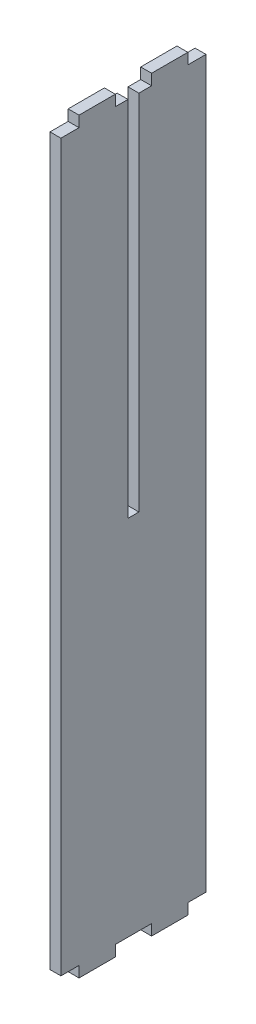
ISO-10303-21;
HEADER;
FILE_DESCRIPTION(('STEP AP214'),'2;1');
FILE_NAME('part.step','',(''),(''),'','','');
FILE_SCHEMA(('AUTOMOTIVE_DESIGN { 1 0 10303 214 1 1 1 1 }'));
ENDSEC;
DATA;
#1=APPLICATION_CONTEXT('core data for automotive mechanical design processes');
#2=APPLICATION_PROTOCOL_DEFINITION('international standard','automotive_design',2000,#1);
#3=PRODUCT_CONTEXT('',#1,'mechanical');
#4=PRODUCT('Part','Part','',(#3));
#5=PRODUCT_RELATED_PRODUCT_CATEGORY('part','',(#4));
#6=PRODUCT_DEFINITION_FORMATION('','',#4);
#7=PRODUCT_DEFINITION_CONTEXT('part definition',#1,'design');
#8=PRODUCT_DEFINITION('design','',#6,#7);
#9=PRODUCT_DEFINITION_SHAPE('','',#8);
#10=(LENGTH_UNIT() NAMED_UNIT(*) SI_UNIT(.MILLI.,.METRE.));
#11=(NAMED_UNIT(*) PLANE_ANGLE_UNIT() SI_UNIT($,.RADIAN.));
#12=(NAMED_UNIT(*) SI_UNIT($,.STERADIAN.) SOLID_ANGLE_UNIT());
#13=UNCERTAINTY_MEASURE_WITH_UNIT(LENGTH_MEASURE(1.E-05),#10,'distance_accuracy_value','');
#14=(GEOMETRIC_REPRESENTATION_CONTEXT(3) GLOBAL_UNCERTAINTY_ASSIGNED_CONTEXT((#13)) GLOBAL_UNIT_ASSIGNED_CONTEXT((#10,
#11,#12)) REPRESENTATION_CONTEXT('',''));
#15=CARTESIAN_POINT('',(0.,0.,0.));
#16=DIRECTION('',(0.,0.,1.));
#17=DIRECTION('',(1.,0.,0.));
#18=AXIS2_PLACEMENT_3D('',#15,#16,#17);
#19=CARTESIAN_POINT('',(1.5,200.,5.));
#20=DIRECTION('',(0.,-1.,0.));
#21=DIRECTION('',(0.,0.,-1.));
#22=AXIS2_PLACEMENT_3D('',#19,#20,#21);
#23=PLANE('',#22);
#24=DIRECTION('',(0.,0.,1.));
#25=VECTOR('',#24,1.);
#26=CARTESIAN_POINT('',(1.5,200.,5.));
#27=LINE('',#26,#25);
#28=CARTESIAN_POINT('',(1.5,200.,1.5));
#29=VERTEX_POINT('',#28);
#30=CARTESIAN_POINT('',(1.5,200.,5.));
#31=VERTEX_POINT('',#30);
#32=EDGE_CURVE('E383',#29,#31,#27,.T.);
#33=ORIENTED_EDGE('',*,*,#32,.F.);
#34=DIRECTION('',(1.,0.,0.));
#35=VECTOR('',#34,1.);
#36=CARTESIAN_POINT('',(-1.501,200.,1.5));
#37=LINE('',#36,#35);
#38=CARTESIAN_POINT('',(-1.5,200.,1.5));
#39=VERTEX_POINT('',#38);
#40=EDGE_CURVE('E464',#39,#29,#37,.T.);
#41=ORIENTED_EDGE('',*,*,#40,.F.);
#42=DIRECTION('',(0.,0.,1.));
#43=VECTOR('',#42,1.);
#44=CARTESIAN_POINT('',(-1.5,200.,5.));
#45=LINE('',#44,#43);
#46=CARTESIAN_POINT('',(-1.5,200.,5.));
#47=VERTEX_POINT('',#46);
#48=EDGE_CURVE('E240',#39,#47,#45,.T.);
#49=ORIENTED_EDGE('',*,*,#48,.T.);
#50=DIRECTION('',(-1.,0.,0.));
#51=VECTOR('',#50,1.);
#52=CARTESIAN_POINT('',(1.5,200.,5.));
#53=LINE('',#52,#51);
#54=EDGE_CURVE('E339',#31,#47,#53,.T.);
#55=ORIENTED_EDGE('',*,*,#54,.F.);
#56=EDGE_LOOP('',(#33,#41,#49,#55));
#57=FACE_BOUND('',#56,.T.);
#58=ADVANCED_FACE('F39',(#57),#23,.F.);
#59=CARTESIAN_POINT('',(1.5,200.,-20.));
#60=DIRECTION('',(0.,-1.,0.));
#61=DIRECTION('',(0.,0.,-1.));
#62=AXIS2_PLACEMENT_3D('',#59,#60,#61);
#63=PLANE('',#62);
#64=DIRECTION('',(0.,0.,1.));
#65=VECTOR('',#64,1.);
#66=CARTESIAN_POINT('',(-1.5,200.,-20.));
#67=LINE('',#66,#65);
#68=CARTESIAN_POINT('',(-1.5,200.,-20.));
#69=VERTEX_POINT('',#68);
#70=CARTESIAN_POINT('',(-1.5,200.,-15.));
#71=VERTEX_POINT('',#70);
#72=EDGE_CURVE('E226',#69,#71,#67,.T.);
#73=ORIENTED_EDGE('',*,*,#72,.T.);
#74=DIRECTION('',(-1.,0.,0.));
#75=VECTOR('',#74,1.);
#76=CARTESIAN_POINT('',(1.5,200.,-15.));
#77=LINE('',#76,#75);
#78=CARTESIAN_POINT('',(1.5,200.,-15.));
#79=VERTEX_POINT('',#78);
#80=EDGE_CURVE('E11',#79,#71,#77,.T.);
#81=ORIENTED_EDGE('',*,*,#80,.F.);
#82=DIRECTION('',(0.,0.,1.));
#83=VECTOR('',#82,1.);
#84=CARTESIAN_POINT('',(1.5,200.,-20.));
#85=LINE('',#84,#83);
#86=CARTESIAN_POINT('',(1.5,200.,-20.));
#87=VERTEX_POINT('',#86);
#88=EDGE_CURVE('E288',#87,#79,#85,.T.);
#89=ORIENTED_EDGE('',*,*,#88,.F.);
#90=DIRECTION('',(-1.,0.,0.));
#91=VECTOR('',#90,1.);
#92=CARTESIAN_POINT('',(1.5,200.,-20.));
#93=LINE('',#92,#91);
#94=EDGE_CURVE('E222',#87,#69,#93,.T.);
#95=ORIENTED_EDGE('',*,*,#94,.T.);
#96=EDGE_LOOP('',(#73,#81,#89,#95));
#97=FACE_BOUND('',#96,.T.);
#98=ADVANCED_FACE('F41',(#97),#63,.F.);
#99=CARTESIAN_POINT('',(1.5,200.,-15.));
#100=DIRECTION('',(0.,0.,1.));
#101=DIRECTION('',(1.,0.,0.));
#102=AXIS2_PLACEMENT_3D('',#99,#100,#101);
#103=PLANE('',#102);
#104=DIRECTION('',(0.,1.,0.));
#105=VECTOR('',#104,1.);
#106=CARTESIAN_POINT('',(-1.5,200.,-15.));
#107=LINE('',#106,#105);
#108=CARTESIAN_POINT('',(-1.5,203.,-15.));
#109=VERTEX_POINT('',#108);
#110=EDGE_CURVE('E230',#71,#109,#107,.T.);
#111=ORIENTED_EDGE('',*,*,#110,.T.);
#112=DIRECTION('',(-1.,0.,0.));
#113=VECTOR('',#112,1.);
#114=CARTESIAN_POINT('',(1.5,203.,-15.));
#115=LINE('',#114,#113);
#116=CARTESIAN_POINT('',(1.5,203.,-15.));
#117=VERTEX_POINT('',#116);
#118=EDGE_CURVE('E48',#117,#109,#115,.T.);
#119=ORIENTED_EDGE('',*,*,#118,.F.);
#120=DIRECTION('',(0.,1.,0.));
#121=VECTOR('',#120,1.);
#122=CARTESIAN_POINT('',(1.5,200.,-15.));
#123=LINE('',#122,#121);
#124=EDGE_CURVE('E141',#79,#117,#123,.T.);
#125=ORIENTED_EDGE('',*,*,#124,.F.);
#126=ORIENTED_EDGE('',*,*,#80,.T.);
#127=EDGE_LOOP('',(#111,#119,#125,#126));
#128=FACE_BOUND('',#127,.T.);
#129=ADVANCED_FACE('F598',(#128),#103,.F.);
#130=CARTESIAN_POINT('',(1.5,203.,-15.));
#131=DIRECTION('',(0.,-1.,0.));
#132=DIRECTION('',(0.,0.,-1.));
#133=AXIS2_PLACEMENT_3D('',#130,#131,#132);
#134=PLANE('',#133);
#135=DIRECTION('',(0.,0.,1.));
#136=VECTOR('',#135,1.);
#137=CARTESIAN_POINT('',(-1.5,203.,-15.));
#138=LINE('',#137,#136);
#139=CARTESIAN_POINT('',(-1.5,203.,-5.));
#140=VERTEX_POINT('',#139);
#141=EDGE_CURVE('E234',#109,#140,#138,.T.);
#142=ORIENTED_EDGE('',*,*,#141,.T.);
#143=DIRECTION('',(-1.,0.,0.));
#144=VECTOR('',#143,1.);
#145=CARTESIAN_POINT('',(1.5,203.,-5.));
#146=LINE('',#145,#144);
#147=CARTESIAN_POINT('',(1.5,203.,-5.));
#148=VERTEX_POINT('',#147);
#149=EDGE_CURVE('E347',#148,#140,#146,.T.);
#150=ORIENTED_EDGE('',*,*,#149,.F.);
#151=DIRECTION('',(0.,0.,1.));
#152=VECTOR('',#151,1.);
#153=CARTESIAN_POINT('',(1.5,203.,-15.));
#154=LINE('',#153,#152);
#155=EDGE_CURVE('E358',#117,#148,#154,.T.);
#156=ORIENTED_EDGE('',*,*,#155,.F.);
#157=ORIENTED_EDGE('',*,*,#118,.T.);
#158=EDGE_LOOP('',(#142,#150,#156,#157));
#159=FACE_BOUND('',#158,.T.);
#160=ADVANCED_FACE('F356',(#159),#134,.F.);
#161=CARTESIAN_POINT('',(1.5,200.,-5.));
#162=DIRECTION('',(0.,0.,-1.));
#163=DIRECTION('',(0.,1.,0.));
#164=AXIS2_PLACEMENT_3D('',#161,#162,#163);
#165=PLANE('',#164);
#166=DIRECTION('',(0.,-1.,0.));
#167=VECTOR('',#166,1.);
#168=CARTESIAN_POINT('',(-1.5,200.,-5.));
#169=LINE('',#168,#167);
#170=CARTESIAN_POINT('',(-1.5,200.,-5.));
#171=VERTEX_POINT('',#170);
#172=EDGE_CURVE('E237',#140,#171,#169,.T.);
#173=ORIENTED_EDGE('',*,*,#172,.T.);
#174=DIRECTION('',(-1.,0.,0.));
#175=VECTOR('',#174,1.);
#176=CARTESIAN_POINT('',(1.5,200.,-5.));
#177=LINE('',#176,#175);
#178=CARTESIAN_POINT('',(1.5,200.,-5.));
#179=VERTEX_POINT('',#178);
#180=EDGE_CURVE('E343',#179,#171,#177,.T.);
#181=ORIENTED_EDGE('',*,*,#180,.F.);
#182=DIRECTION('',(0.,-1.,0.));
#183=VECTOR('',#182,1.);
#184=CARTESIAN_POINT('',(1.5,200.,-5.));
#185=LINE('',#184,#183);
#186=EDGE_CURVE('E391',#148,#179,#185,.T.);
#187=ORIENTED_EDGE('',*,*,#186,.F.);
#188=ORIENTED_EDGE('',*,*,#149,.T.);
#189=EDGE_LOOP('',(#173,#181,#187,#188));
#190=FACE_BOUND('',#189,.T.);
#191=ADVANCED_FACE('F368',(#190),#165,.F.);
#192=CARTESIAN_POINT('',(-1.5,200.,-1.49999999999999));
#193=VERTEX_POINT('',#192);
#194=EDGE_CURVE('E241',#171,#193,#45,.T.);
#195=ORIENTED_EDGE('',*,*,#194,.T.);
#196=DIRECTION('',(1.,0.,0.));
#197=VECTOR('',#196,1.);
#198=CARTESIAN_POINT('',(-1.501,200.,-1.5));
#199=LINE('',#198,#197);
#200=CARTESIAN_POINT('',(1.5,200.,-1.5));
#201=VERTEX_POINT('',#200);
#202=EDGE_CURVE('E379',#193,#201,#199,.T.);
#203=ORIENTED_EDGE('',*,*,#202,.T.);
#204=EDGE_CURVE('E376',#179,#201,#27,.T.);
#205=ORIENTED_EDGE('',*,*,#204,.F.);
#206=ORIENTED_EDGE('',*,*,#180,.T.);
#207=EDGE_LOOP('',(#195,#203,#205,#206));
#208=FACE_BOUND('',#207,.T.);
#209=ADVANCED_FACE('F372',(#208),#23,.F.);
#210=CARTESIAN_POINT('',(1.5,203.,5.));
#211=DIRECTION('',(0.,0.,1.));
#212=DIRECTION('',(0.,-1.,0.));
#213=AXIS2_PLACEMENT_3D('',#210,#211,#212);
#214=PLANE('',#213);
#215=DIRECTION('',(0.,1.,0.));
#216=VECTOR('',#215,1.);
#217=CARTESIAN_POINT('',(-1.5,203.,5.));
#218=LINE('',#217,#216);
#219=CARTESIAN_POINT('',(-1.5,203.,5.));
#220=VERTEX_POINT('',#219);
#221=EDGE_CURVE('E245',#47,#220,#218,.T.);
#222=ORIENTED_EDGE('',*,*,#221,.T.);
#223=DIRECTION('',(-1.,0.,0.));
#224=VECTOR('',#223,1.);
#225=CARTESIAN_POINT('',(1.5,203.,5.));
#226=LINE('',#225,#224);
#227=CARTESIAN_POINT('',(1.5,203.,5.));
#228=VERTEX_POINT('',#227);
#229=EDGE_CURVE('E335',#228,#220,#226,.T.);
#230=ORIENTED_EDGE('',*,*,#229,.F.);
#231=DIRECTION('',(0.,1.,0.));
#232=VECTOR('',#231,1.);
#233=CARTESIAN_POINT('',(1.5,203.,5.));
#234=LINE('',#233,#232);
#235=EDGE_CURVE('E382',#31,#228,#234,.T.);
#236=ORIENTED_EDGE('',*,*,#235,.F.);
#237=ORIENTED_EDGE('',*,*,#54,.T.);
#238=EDGE_LOOP('',(#222,#230,#236,#237));
#239=FACE_BOUND('',#238,.T.);
#240=ADVANCED_FACE('F542',(#239),#214,.F.);
#241=CARTESIAN_POINT('',(1.5,203.,15.));
#242=DIRECTION('',(0.,-1.,0.));
#243=DIRECTION('',(0.,0.,-1.));
#244=AXIS2_PLACEMENT_3D('',#241,#242,#243);
#245=PLANE('',#244);
#246=DIRECTION('',(0.,0.,1.));
#247=VECTOR('',#246,1.);
#248=CARTESIAN_POINT('',(-1.5,203.,15.));
#249=LINE('',#248,#247);
#250=CARTESIAN_POINT('',(-1.5,203.,15.));
#251=VERTEX_POINT('',#250);
#252=EDGE_CURVE('E248',#220,#251,#249,.T.);
#253=ORIENTED_EDGE('',*,*,#252,.T.);
#254=DIRECTION('',(-1.,0.,0.));
#255=VECTOR('',#254,1.);
#256=CARTESIAN_POINT('',(1.5,203.,15.));
#257=LINE('',#256,#255);
#258=CARTESIAN_POINT('',(1.5,203.,15.));
#259=VERTEX_POINT('',#258);
#260=EDGE_CURVE('E331',#259,#251,#257,.T.);
#261=ORIENTED_EDGE('',*,*,#260,.F.);
#262=DIRECTION('',(0.,0.,1.));
#263=VECTOR('',#262,1.);
#264=CARTESIAN_POINT('',(1.5,203.,15.));
#265=LINE('',#264,#263);
#266=EDGE_CURVE('E388',#228,#259,#265,.T.);
#267=ORIENTED_EDGE('',*,*,#266,.F.);
#268=ORIENTED_EDGE('',*,*,#229,.T.);
#269=EDGE_LOOP('',(#253,#261,#267,#268));
#270=FACE_BOUND('',#269,.T.);
#271=ADVANCED_FACE('F546',(#270),#245,.F.);
#272=CARTESIAN_POINT('',(1.5,200.,15.));
#273=DIRECTION('',(0.,0.,-1.));
#274=DIRECTION('',(-1.,0.,0.));
#275=AXIS2_PLACEMENT_3D('',#272,#273,#274);
#276=PLANE('',#275);
#277=DIRECTION('',(0.,-1.,0.));
#278=VECTOR('',#277,1.);
#279=CARTESIAN_POINT('',(-1.5,200.,15.));
#280=LINE('',#279,#278);
#281=CARTESIAN_POINT('',(-1.5,200.,15.));
#282=VERTEX_POINT('',#281);
#283=EDGE_CURVE('E251',#251,#282,#280,.T.);
#284=ORIENTED_EDGE('',*,*,#283,.T.);
#285=DIRECTION('',(-1.,0.,0.));
#286=VECTOR('',#285,1.);
#287=CARTESIAN_POINT('',(1.5,200.,15.));
#288=LINE('',#287,#286);
#289=CARTESIAN_POINT('',(1.5,200.,15.));
#290=VERTEX_POINT('',#289);
#291=EDGE_CURVE('E327',#290,#282,#288,.T.);
#292=ORIENTED_EDGE('',*,*,#291,.F.);
#293=DIRECTION('',(0.,-1.,0.));
#294=VECTOR('',#293,1.);
#295=CARTESIAN_POINT('',(1.5,200.,15.));
#296=LINE('',#295,#294);
#297=EDGE_CURVE('E397',#259,#290,#296,.T.);
#298=ORIENTED_EDGE('',*,*,#297,.F.);
#299=ORIENTED_EDGE('',*,*,#260,.T.);
#300=EDGE_LOOP('',(#284,#292,#298,#299));
#301=FACE_BOUND('',#300,.T.);
#302=ADVANCED_FACE('F553',(#301),#276,.F.);
#303=CARTESIAN_POINT('',(1.5,200.,20.));
#304=DIRECTION('',(0.,-1.,0.));
#305=DIRECTION('',(0.,0.,-1.));
#306=AXIS2_PLACEMENT_3D('',#303,#304,#305);
#307=PLANE('',#306);
#308=DIRECTION('',(0.,0.,1.));
#309=VECTOR('',#308,1.);
#310=CARTESIAN_POINT('',(-1.5,200.,20.));
#311=LINE('',#310,#309);
#312=CARTESIAN_POINT('',(-1.5,200.,20.));
#313=VERTEX_POINT('',#312);
#314=EDGE_CURVE('E254',#282,#313,#311,.T.);
#315=ORIENTED_EDGE('',*,*,#314,.T.);
#316=DIRECTION('',(-1.,0.,0.));
#317=VECTOR('',#316,1.);
#318=CARTESIAN_POINT('',(1.5,200.,20.));
#319=LINE('',#318,#317);
#320=CARTESIAN_POINT('',(1.5,200.,20.));
#321=VERTEX_POINT('',#320);
#322=EDGE_CURVE('E323',#321,#313,#319,.T.);
#323=ORIENTED_EDGE('',*,*,#322,.F.);
#324=DIRECTION('',(0.,0.,1.));
#325=VECTOR('',#324,1.);
#326=CARTESIAN_POINT('',(1.5,200.,20.));
#327=LINE('',#326,#325);
#328=EDGE_CURVE('E400',#290,#321,#327,.T.);
#329=ORIENTED_EDGE('',*,*,#328,.F.);
#330=ORIENTED_EDGE('',*,*,#291,.T.);
#331=EDGE_LOOP('',(#315,#323,#329,#330));
#332=FACE_BOUND('',#331,.T.);
#333=ADVANCED_FACE('F556',(#332),#307,.F.);
#334=CARTESIAN_POINT('',(1.5,0.,20.));
#335=DIRECTION('',(0.,0.,-1.));
#336=DIRECTION('',(-1.,0.,0.));
#337=AXIS2_PLACEMENT_3D('',#334,#335,#336);
#338=PLANE('',#337);
#339=DIRECTION('',(0.,-1.,0.));
#340=VECTOR('',#339,1.);
#341=CARTESIAN_POINT('',(-1.5,0.,20.));
#342=LINE('',#341,#340);
#343=CARTESIAN_POINT('',(-1.5,0.,20.));
#344=VERTEX_POINT('',#343);
#345=EDGE_CURVE('E257',#313,#344,#342,.T.);
#346=ORIENTED_EDGE('',*,*,#345,.T.);
#347=DIRECTION('',(-1.,0.,0.));
#348=VECTOR('',#347,1.);
#349=CARTESIAN_POINT('',(1.5,0.,20.));
#350=LINE('',#349,#348);
#351=CARTESIAN_POINT('',(1.5,0.,20.));
#352=VERTEX_POINT('',#351);
#353=EDGE_CURVE('E319',#352,#344,#350,.T.);
#354=ORIENTED_EDGE('',*,*,#353,.F.);
#355=DIRECTION('',(0.,-1.,0.));
#356=VECTOR('',#355,1.);
#357=CARTESIAN_POINT('',(1.5,0.,20.));
#358=LINE('',#357,#356);
#359=EDGE_CURVE('E403',#321,#352,#358,.T.);
#360=ORIENTED_EDGE('',*,*,#359,.F.);
#361=ORIENTED_EDGE('',*,*,#322,.T.);
#362=EDGE_LOOP('',(#346,#354,#360,#361));
#363=FACE_BOUND('',#362,.T.);
#364=ADVANCED_FACE('F561',(#363),#338,.F.);
#365=CARTESIAN_POINT('',(1.5,0.,20.));
#366=DIRECTION('',(0.,1.,0.));
#367=DIRECTION('',(0.,0.,1.));
#368=AXIS2_PLACEMENT_3D('',#365,#366,#367);
#369=PLANE('',#368);
#370=DIRECTION('',(0.,0.,-1.));
#371=VECTOR('',#370,1.);
#372=CARTESIAN_POINT('',(-1.5,0.,20.));
#373=LINE('',#372,#371);
#374=CARTESIAN_POINT('',(-1.5,0.,15.));
#375=VERTEX_POINT('',#374);
#376=EDGE_CURVE('E260',#344,#375,#373,.T.);
#377=ORIENTED_EDGE('',*,*,#376,.T.);
#378=DIRECTION('',(-1.,0.,0.));
#379=VECTOR('',#378,1.);
#380=CARTESIAN_POINT('',(1.5,0.,15.));
#381=LINE('',#380,#379);
#382=CARTESIAN_POINT('',(1.5,0.,15.));
#383=VERTEX_POINT('',#382);
#384=EDGE_CURVE('E315',#383,#375,#381,.T.);
#385=ORIENTED_EDGE('',*,*,#384,.F.);
#386=DIRECTION('',(0.,0.,-1.));
#387=VECTOR('',#386,1.);
#388=CARTESIAN_POINT('',(1.5,0.,20.));
#389=LINE('',#388,#387);
#390=EDGE_CURVE('E406',#352,#383,#389,.T.);
#391=ORIENTED_EDGE('',*,*,#390,.F.);
#392=ORIENTED_EDGE('',*,*,#353,.T.);
#393=EDGE_LOOP('',(#377,#385,#391,#392));
#394=FACE_BOUND('',#393,.T.);
#395=ADVANCED_FACE('F567',(#394),#369,.F.);
#396=CARTESIAN_POINT('',(1.5,0.,15.));
#397=DIRECTION('',(0.,0.,-1.));
#398=DIRECTION('',(0.,1.,0.));
#399=AXIS2_PLACEMENT_3D('',#396,#397,#398);
#400=PLANE('',#399);
#401=DIRECTION('',(0.,-1.,0.));
#402=VECTOR('',#401,1.);
#403=CARTESIAN_POINT('',(-1.5,0.,15.));
#404=LINE('',#403,#402);
#405=CARTESIAN_POINT('',(-1.5,-3.,15.));
#406=VERTEX_POINT('',#405);
#407=EDGE_CURVE('E263',#375,#406,#404,.T.);
#408=ORIENTED_EDGE('',*,*,#407,.T.);
#409=DIRECTION('',(-1.,0.,0.));
#410=VECTOR('',#409,1.);
#411=CARTESIAN_POINT('',(1.5,-3.,15.));
#412=LINE('',#411,#410);
#413=CARTESIAN_POINT('',(1.5,-3.,15.));
#414=VERTEX_POINT('',#413);
#415=EDGE_CURVE('E311',#414,#406,#412,.T.);
#416=ORIENTED_EDGE('',*,*,#415,.F.);
#417=DIRECTION('',(0.,-1.,0.));
#418=VECTOR('',#417,1.);
#419=CARTESIAN_POINT('',(1.5,0.,15.));
#420=LINE('',#419,#418);
#421=EDGE_CURVE('E409',#383,#414,#420,.T.);
#422=ORIENTED_EDGE('',*,*,#421,.F.);
#423=ORIENTED_EDGE('',*,*,#384,.T.);
#424=EDGE_LOOP('',(#408,#416,#422,#423));
#425=FACE_BOUND('',#424,.T.);
#426=ADVANCED_FACE('F571',(#425),#400,.F.);
#427=CARTESIAN_POINT('',(1.5,-3.,15.));
#428=DIRECTION('',(0.,1.,0.));
#429=DIRECTION('',(0.,0.,1.));
#430=AXIS2_PLACEMENT_3D('',#427,#428,#429);
#431=PLANE('',#430);
#432=DIRECTION('',(0.,0.,-1.));
#433=VECTOR('',#432,1.);
#434=CARTESIAN_POINT('',(-1.5,-3.,15.));
#435=LINE('',#434,#433);
#436=CARTESIAN_POINT('',(-1.5,-3.,4.99999999999998));
#437=VERTEX_POINT('',#436);
#438=EDGE_CURVE('E266',#406,#437,#435,.T.);
#439=ORIENTED_EDGE('',*,*,#438,.T.);
#440=DIRECTION('',(-1.,0.,0.));
#441=VECTOR('',#440,1.);
#442=CARTESIAN_POINT('',(1.5,-3.,4.99999999999998));
#443=LINE('',#442,#441);
#444=CARTESIAN_POINT('',(1.5,-3.,4.99999999999998));
#445=VERTEX_POINT('',#444);
#446=EDGE_CURVE('E307',#445,#437,#443,.T.);
#447=ORIENTED_EDGE('',*,*,#446,.F.);
#448=DIRECTION('',(0.,0.,-1.));
#449=VECTOR('',#448,1.);
#450=CARTESIAN_POINT('',(1.5,-3.,15.));
#451=LINE('',#450,#449);
#452=EDGE_CURVE('E412',#414,#445,#451,.T.);
#453=ORIENTED_EDGE('',*,*,#452,.F.);
#454=ORIENTED_EDGE('',*,*,#415,.T.);
#455=EDGE_LOOP('',(#439,#447,#453,#454));
#456=FACE_BOUND('',#455,.T.);
#457=ADVANCED_FACE('F576',(#456),#431,.F.);
#458=CARTESIAN_POINT('',(1.5,-3.,4.99999999999998));
#459=DIRECTION('',(0.,0.,1.));
#460=DIRECTION('',(1.,0.,0.));
#461=AXIS2_PLACEMENT_3D('',#458,#459,#460);
#462=PLANE('',#461);
#463=DIRECTION('',(0.,1.,0.));
#464=VECTOR('',#463,1.);
#465=CARTESIAN_POINT('',(-1.5,-3.,4.99999999999998));
#466=LINE('',#465,#464);
#467=CARTESIAN_POINT('',(-1.5,0.,4.99999999999998));
#468=VERTEX_POINT('',#467);
#469=EDGE_CURVE('E269',#437,#468,#466,.T.);
#470=ORIENTED_EDGE('',*,*,#469,.T.);
#471=DIRECTION('',(-1.,0.,0.));
#472=VECTOR('',#471,1.);
#473=CARTESIAN_POINT('',(1.5,0.,4.99999999999998));
#474=LINE('',#473,#472);
#475=CARTESIAN_POINT('',(1.5,0.,4.99999999999998));
#476=VERTEX_POINT('',#475);
#477=EDGE_CURVE('E303',#476,#468,#474,.T.);
#478=ORIENTED_EDGE('',*,*,#477,.F.);
#479=DIRECTION('',(0.,1.,0.));
#480=VECTOR('',#479,1.);
#481=CARTESIAN_POINT('',(1.5,-3.,4.99999999999998));
#482=LINE('',#481,#480);
#483=EDGE_CURVE('E415',#445,#476,#482,.T.);
#484=ORIENTED_EDGE('',*,*,#483,.F.);
#485=ORIENTED_EDGE('',*,*,#446,.T.);
#486=EDGE_LOOP('',(#470,#478,#484,#485));
#487=FACE_BOUND('',#486,.T.);
#488=ADVANCED_FACE('F580',(#487),#462,.F.);
#489=CARTESIAN_POINT('',(1.5,0.,4.99999999999998));
#490=DIRECTION('',(0.,1.,0.));
#491=DIRECTION('',(0.,0.,1.));
#492=AXIS2_PLACEMENT_3D('',#489,#490,#491);
#493=PLANE('',#492);
#494=DIRECTION('',(0.,0.,-1.));
#495=VECTOR('',#494,1.);
#496=CARTESIAN_POINT('',(-1.5,0.,4.99999999999998));
#497=LINE('',#496,#495);
#498=CARTESIAN_POINT('',(-1.5,0.,-4.99999999999998));
#499=VERTEX_POINT('',#498);
#500=EDGE_CURVE('E272',#468,#499,#497,.T.);
#501=ORIENTED_EDGE('',*,*,#500,.T.);
#502=DIRECTION('',(-1.,0.,0.));
#503=VECTOR('',#502,1.);
#504=CARTESIAN_POINT('',(1.5,0.,-4.99999999999998));
#505=LINE('',#504,#503);
#506=CARTESIAN_POINT('',(1.5,0.,-4.99999999999998));
#507=VERTEX_POINT('',#506);
#508=EDGE_CURVE('E299',#507,#499,#505,.T.);
#509=ORIENTED_EDGE('',*,*,#508,.F.);
#510=DIRECTION('',(0.,0.,-1.));
#511=VECTOR('',#510,1.);
#512=CARTESIAN_POINT('',(1.5,0.,4.99999999999998));
#513=LINE('',#512,#511);
#514=EDGE_CURVE('E418',#476,#507,#513,.T.);
#515=ORIENTED_EDGE('',*,*,#514,.F.);
#516=ORIENTED_EDGE('',*,*,#477,.T.);
#517=EDGE_LOOP('',(#501,#509,#515,#516));
#518=FACE_BOUND('',#517,.T.);
#519=ADVANCED_FACE('F584',(#518),#493,.F.);
#520=CARTESIAN_POINT('',(1.5,0.,-4.99999999999998));
#521=DIRECTION('',(0.,0.,-1.));
#522=DIRECTION('',(-1.,0.,0.));
#523=AXIS2_PLACEMENT_3D('',#520,#521,#522);
#524=PLANE('',#523);
#525=DIRECTION('',(0.,-1.,0.));
#526=VECTOR('',#525,1.);
#527=CARTESIAN_POINT('',(-1.5,0.,-4.99999999999998));
#528=LINE('',#527,#526);
#529=CARTESIAN_POINT('',(-1.5,-3.,-4.99999999999998));
#530=VERTEX_POINT('',#529);
#531=EDGE_CURVE('E275',#499,#530,#528,.T.);
#532=ORIENTED_EDGE('',*,*,#531,.T.);
#533=DIRECTION('',(-1.,0.,0.));
#534=VECTOR('',#533,1.);
#535=CARTESIAN_POINT('',(1.5,-3.,-4.99999999999998));
#536=LINE('',#535,#534);
#537=CARTESIAN_POINT('',(1.5,-3.,-4.99999999999998));
#538=VERTEX_POINT('',#537);
#539=EDGE_CURVE('E295',#538,#530,#536,.T.);
#540=ORIENTED_EDGE('',*,*,#539,.F.);
#541=DIRECTION('',(0.,-1.,0.));
#542=VECTOR('',#541,1.);
#543=CARTESIAN_POINT('',(1.5,0.,-4.99999999999998));
#544=LINE('',#543,#542);
#545=EDGE_CURVE('E421',#507,#538,#544,.T.);
#546=ORIENTED_EDGE('',*,*,#545,.F.);
#547=ORIENTED_EDGE('',*,*,#508,.T.);
#548=EDGE_LOOP('',(#532,#540,#546,#547));
#549=FACE_BOUND('',#548,.T.);
#550=ADVANCED_FACE('F442',(#549),#524,.F.);
#551=CARTESIAN_POINT('',(1.5,-3.,-4.99999999999998));
#552=DIRECTION('',(0.,1.,0.));
#553=DIRECTION('',(0.,0.,1.));
#554=AXIS2_PLACEMENT_3D('',#551,#552,#553);
#555=PLANE('',#554);
#556=DIRECTION('',(0.,0.,-1.));
#557=VECTOR('',#556,1.);
#558=CARTESIAN_POINT('',(-1.5,-3.,-4.99999999999998));
#559=LINE('',#558,#557);
#560=CARTESIAN_POINT('',(-1.5,-3.,-15.));
#561=VERTEX_POINT('',#560);
#562=EDGE_CURVE('E278',#530,#561,#559,.T.);
#563=ORIENTED_EDGE('',*,*,#562,.T.);
#564=DIRECTION('',(-1.,0.,0.));
#565=VECTOR('',#564,1.);
#566=CARTESIAN_POINT('',(1.5,-3.,-15.));
#567=LINE('',#566,#565);
#568=CARTESIAN_POINT('',(1.5,-3.,-15.));
#569=VERTEX_POINT('',#568);
#570=EDGE_CURVE('E214',#569,#561,#567,.T.);
#571=ORIENTED_EDGE('',*,*,#570,.F.);
#572=DIRECTION('',(0.,0.,-1.));
#573=VECTOR('',#572,1.);
#574=CARTESIAN_POINT('',(1.5,-3.,-4.99999999999998));
#575=LINE('',#574,#573);
#576=EDGE_CURVE('E200',#538,#569,#575,.T.);
#577=ORIENTED_EDGE('',*,*,#576,.F.);
#578=ORIENTED_EDGE('',*,*,#539,.T.);
#579=EDGE_LOOP('',(#563,#571,#577,#578));
#580=FACE_BOUND('',#579,.T.);
#581=ADVANCED_FACE('F446',(#580),#555,.F.);
#582=CARTESIAN_POINT('',(1.5,-3.,-15.));
#583=DIRECTION('',(0.,0.,1.));
#584=DIRECTION('',(0.,-1.,0.));
#585=AXIS2_PLACEMENT_3D('',#582,#583,#584);
#586=PLANE('',#585);
#587=DIRECTION('',(0.,1.,0.));
#588=VECTOR('',#587,1.);
#589=CARTESIAN_POINT('',(-1.5,-3.,-15.));
#590=LINE('',#589,#588);
#591=CARTESIAN_POINT('',(-1.5,0.,-15.));
#592=VERTEX_POINT('',#591);
#593=EDGE_CURVE('E210',#561,#592,#590,.T.);
#594=ORIENTED_EDGE('',*,*,#593,.T.);
#595=DIRECTION('',(-1.,0.,0.));
#596=VECTOR('',#595,1.);
#597=CARTESIAN_POINT('',(1.5,0.,-15.));
#598=LINE('',#597,#596);
#599=CARTESIAN_POINT('',(1.5,0.,-15.));
#600=VERTEX_POINT('',#599);
#601=EDGE_CURVE('E207',#600,#592,#598,.T.);
#602=ORIENTED_EDGE('',*,*,#601,.F.);
#603=DIRECTION('',(0.,1.,0.));
#604=VECTOR('',#603,1.);
#605=CARTESIAN_POINT('',(1.5,-3.,-15.));
#606=LINE('',#605,#604);
#607=EDGE_CURVE('E192',#569,#600,#606,.T.);
#608=ORIENTED_EDGE('',*,*,#607,.F.);
#609=ORIENTED_EDGE('',*,*,#570,.T.);
#610=EDGE_LOOP('',(#594,#602,#608,#609));
#611=FACE_BOUND('',#610,.T.);
#612=ADVANCED_FACE('F208',(#611),#586,.F.);
#613=CARTESIAN_POINT('',(1.5,0.,-15.));
#614=DIRECTION('',(0.,1.,0.));
#615=DIRECTION('',(0.,0.,1.));
#616=AXIS2_PLACEMENT_3D('',#613,#614,#615);
#617=PLANE('',#616);
#618=DIRECTION('',(0.,0.,-1.));
#619=VECTOR('',#618,1.);
#620=CARTESIAN_POINT('',(-1.5,0.,-15.));
#621=LINE('',#620,#619);
#622=CARTESIAN_POINT('',(-1.5,0.,-20.));
#623=VERTEX_POINT('',#622);
#624=EDGE_CURVE('E283',#592,#623,#621,.T.);
#625=ORIENTED_EDGE('',*,*,#624,.T.);
#626=DIRECTION('',(-1.,0.,0.));
#627=VECTOR('',#626,1.);
#628=CARTESIAN_POINT('',(1.5,0.,-20.));
#629=LINE('',#628,#627);
#630=CARTESIAN_POINT('',(1.5,0.,-20.));
#631=VERTEX_POINT('',#630);
#632=EDGE_CURVE('E215',#631,#623,#629,.T.);
#633=ORIENTED_EDGE('',*,*,#632,.F.);
#634=DIRECTION('',(0.,0.,-1.));
#635=VECTOR('',#634,1.);
#636=CARTESIAN_POINT('',(1.5,0.,-15.));
#637=LINE('',#636,#635);
#638=EDGE_CURVE('E197',#600,#631,#637,.T.);
#639=ORIENTED_EDGE('',*,*,#638,.F.);
#640=ORIENTED_EDGE('',*,*,#601,.T.);
#641=EDGE_LOOP('',(#625,#633,#639,#640));
#642=FACE_BOUND('',#641,.T.);
#643=ADVANCED_FACE('F217',(#642),#617,.F.);
#644=CARTESIAN_POINT('',(1.5,0.,-20.));
#645=DIRECTION('',(0.,0.,1.));
#646=DIRECTION('',(1.,0.,0.));
#647=AXIS2_PLACEMENT_3D('',#644,#645,#646);
#648=PLANE('',#647);
#649=DIRECTION('',(0.,1.,0.));
#650=VECTOR('',#649,1.);
#651=CARTESIAN_POINT('',(-1.5,0.,-20.));
#652=LINE('',#651,#650);
#653=EDGE_CURVE('E133',#623,#69,#652,.T.);
#654=ORIENTED_EDGE('',*,*,#653,.T.);
#655=ORIENTED_EDGE('',*,*,#94,.F.);
#656=DIRECTION('',(0.,1.,0.));
#657=VECTOR('',#656,1.);
#658=CARTESIAN_POINT('',(1.5,0.,-20.));
#659=LINE('',#658,#657);
#660=EDGE_CURVE('E64',#631,#87,#659,.T.);
#661=ORIENTED_EDGE('',*,*,#660,.F.);
#662=ORIENTED_EDGE('',*,*,#632,.T.);
#663=EDGE_LOOP('',(#654,#655,#661,#662));
#664=FACE_BOUND('',#663,.T.);
#665=ADVANCED_FACE('F447',(#664),#648,.F.);
#666=CARTESIAN_POINT('',(1.5,0.,0.));
#667=DIRECTION('',(-1.,0.,0.));
#668=DIRECTION('',(0.,0.,1.));
#669=AXIS2_PLACEMENT_3D('',#666,#667,#668);
#670=PLANE('',#669);
#671=DIRECTION('',(0.,0.,-1.));
#672=VECTOR('',#671,1.);
#673=CARTESIAN_POINT('',(1.5,100.,1.49999999999999));
#674=LINE('',#673,#672);
#675=CARTESIAN_POINT('',(1.5,100.,1.49999999999999));
#676=VERTEX_POINT('',#675);
#677=CARTESIAN_POINT('',(1.5,100.,-1.49999999999999));
#678=VERTEX_POINT('',#677);
#679=EDGE_CURVE('E480',#676,#678,#674,.T.);
#680=ORIENTED_EDGE('',*,*,#679,.F.);
#681=DIRECTION('',(0.,-1.,0.));
#682=VECTOR('',#681,1.);
#683=CARTESIAN_POINT('',(1.5,200.,1.5));
#684=LINE('',#683,#682);
#685=EDGE_CURVE('E483',#29,#676,#684,.T.);
#686=ORIENTED_EDGE('',*,*,#685,.F.);
#687=ORIENTED_EDGE('',*,*,#32,.T.);
#688=ORIENTED_EDGE('',*,*,#235,.T.);
#689=ORIENTED_EDGE('',*,*,#266,.T.);
#690=ORIENTED_EDGE('',*,*,#297,.T.);
#691=ORIENTED_EDGE('',*,*,#328,.T.);
#692=ORIENTED_EDGE('',*,*,#359,.T.);
#693=ORIENTED_EDGE('',*,*,#390,.T.);
#694=ORIENTED_EDGE('',*,*,#421,.T.);
#695=ORIENTED_EDGE('',*,*,#452,.T.);
#696=ORIENTED_EDGE('',*,*,#483,.T.);
#697=ORIENTED_EDGE('',*,*,#514,.T.);
#698=ORIENTED_EDGE('',*,*,#545,.T.);
#699=ORIENTED_EDGE('',*,*,#576,.T.);
#700=ORIENTED_EDGE('',*,*,#607,.T.);
#701=ORIENTED_EDGE('',*,*,#638,.T.);
#702=ORIENTED_EDGE('',*,*,#660,.T.);
#703=ORIENTED_EDGE('',*,*,#88,.T.);
#704=ORIENTED_EDGE('',*,*,#124,.T.);
#705=ORIENTED_EDGE('',*,*,#155,.T.);
#706=ORIENTED_EDGE('',*,*,#186,.T.);
#707=ORIENTED_EDGE('',*,*,#204,.T.);
#708=DIRECTION('',(0.,1.,0.));
#709=VECTOR('',#708,1.);
#710=CARTESIAN_POINT('',(1.5,200.,-1.5));
#711=LINE('',#710,#709);
#712=EDGE_CURVE('E469',#678,#201,#711,.T.);
#713=ORIENTED_EDGE('',*,*,#712,.F.);
#714=EDGE_LOOP('',(#680,#686,#687,#688,#689,#690,#691,#692,#693,#694,#695,#696,#697,#698,#699,
#700,#701,#702,#703,#704,#705,#706,#707,#713));
#715=FACE_BOUND('',#714,.T.);
#716=ADVANCED_FACE('F195',(#715),#670,.F.);
#717=CARTESIAN_POINT('',(-1.5,0.,0.));
#718=DIRECTION('',(-1.,0.,0.));
#719=DIRECTION('',(0.,0.,1.));
#720=AXIS2_PLACEMENT_3D('',#717,#718,#719);
#721=PLANE('',#720);
#722=DIRECTION('',(0.,-1.,0.));
#723=VECTOR('',#722,1.);
#724=CARTESIAN_POINT('',(-1.5,200.,1.5));
#725=LINE('',#724,#723);
#726=CARTESIAN_POINT('',(-1.5,100.,1.49999999999999));
#727=VERTEX_POINT('',#726);
#728=EDGE_CURVE('E487',#39,#727,#725,.T.);
#729=ORIENTED_EDGE('',*,*,#728,.T.);
#730=DIRECTION('',(0.,0.,-1.));
#731=VECTOR('',#730,1.);
#732=CARTESIAN_POINT('',(-1.5,100.,1.49999999999999));
#733=LINE('',#732,#731);
#734=CARTESIAN_POINT('',(-1.5,100.,-1.49999999999999));
#735=VERTEX_POINT('',#734);
#736=EDGE_CURVE('E231',#727,#735,#733,.T.);
#737=ORIENTED_EDGE('',*,*,#736,.T.);
#738=DIRECTION('',(0.,1.,0.));
#739=VECTOR('',#738,1.);
#740=CARTESIAN_POINT('',(-1.5,200.,-1.5));
#741=LINE('',#740,#739);
#742=EDGE_CURVE('E490',#735,#193,#741,.T.);
#743=ORIENTED_EDGE('',*,*,#742,.T.);
#744=ORIENTED_EDGE('',*,*,#194,.F.);
#745=ORIENTED_EDGE('',*,*,#172,.F.);
#746=ORIENTED_EDGE('',*,*,#141,.F.);
#747=ORIENTED_EDGE('',*,*,#110,.F.);
#748=ORIENTED_EDGE('',*,*,#72,.F.);
#749=ORIENTED_EDGE('',*,*,#653,.F.);
#750=ORIENTED_EDGE('',*,*,#624,.F.);
#751=ORIENTED_EDGE('',*,*,#593,.F.);
#752=ORIENTED_EDGE('',*,*,#562,.F.);
#753=ORIENTED_EDGE('',*,*,#531,.F.);
#754=ORIENTED_EDGE('',*,*,#500,.F.);
#755=ORIENTED_EDGE('',*,*,#469,.F.);
#756=ORIENTED_EDGE('',*,*,#438,.F.);
#757=ORIENTED_EDGE('',*,*,#407,.F.);
#758=ORIENTED_EDGE('',*,*,#376,.F.);
#759=ORIENTED_EDGE('',*,*,#345,.F.);
#760=ORIENTED_EDGE('',*,*,#314,.F.);
#761=ORIENTED_EDGE('',*,*,#283,.F.);
#762=ORIENTED_EDGE('',*,*,#252,.F.);
#763=ORIENTED_EDGE('',*,*,#221,.F.);
#764=ORIENTED_EDGE('',*,*,#48,.F.);
#765=EDGE_LOOP('',(#729,#737,#743,#744,#745,#746,#747,#748,#749,#750,#751,#752,#753,#754,#755,
#756,#757,#758,#759,#760,#761,#762,#763,#764));
#766=FACE_BOUND('',#765,.T.);
#767=ADVANCED_FACE('F362',(#766),#721,.T.);
#768=CARTESIAN_POINT('',(-1.501,200.,1.5));
#769=DIRECTION('',(0.,0.,1.));
#770=DIRECTION('',(0.,-1.,0.));
#771=AXIS2_PLACEMENT_3D('',#768,#769,#770);
#772=PLANE('',#771);
#773=ORIENTED_EDGE('',*,*,#40,.T.);
#774=ORIENTED_EDGE('',*,*,#685,.T.);
#775=DIRECTION('',(1.,0.,0.));
#776=VECTOR('',#775,1.);
#777=CARTESIAN_POINT('',(-1.501,100.,1.49999999999999));
#778=LINE('',#777,#776);
#779=EDGE_CURVE('E465',#727,#676,#778,.T.);
#780=ORIENTED_EDGE('',*,*,#779,.F.);
#781=ORIENTED_EDGE('',*,*,#728,.F.);
#782=EDGE_LOOP('',(#773,#774,#780,#781));
#783=FACE_BOUND('',#782,.T.);
#784=ADVANCED_FACE('F509',(#783),#772,.F.);
#785=CARTESIAN_POINT('',(-1.501,200.,-1.5));
#786=DIRECTION('',(0.,0.,-1.));
#787=DIRECTION('',(0.,1.,0.));
#788=AXIS2_PLACEMENT_3D('',#785,#786,#787);
#789=PLANE('',#788);
#790=DIRECTION('',(1.,0.,0.));
#791=VECTOR('',#790,1.);
#792=CARTESIAN_POINT('',(-1.501,100.,-1.49999999999999));
#793=LINE('',#792,#791);
#794=EDGE_CURVE('E55',#735,#678,#793,.T.);
#795=ORIENTED_EDGE('',*,*,#794,.T.);
#796=ORIENTED_EDGE('',*,*,#712,.T.);
#797=ORIENTED_EDGE('',*,*,#202,.F.);
#798=ORIENTED_EDGE('',*,*,#742,.F.);
#799=EDGE_LOOP('',(#795,#796,#797,#798));
#800=FACE_BOUND('',#799,.T.);
#801=ADVANCED_FACE('F496',(#800),#789,.F.);
#802=CARTESIAN_POINT('',(-1.501,100.,1.49999999999999));
#803=DIRECTION('',(0.,-1.,0.));
#804=DIRECTION('',(0.,0.,-1.));
#805=AXIS2_PLACEMENT_3D('',#802,#803,#804);
#806=PLANE('',#805);
#807=ORIENTED_EDGE('',*,*,#779,.T.);
#808=ORIENTED_EDGE('',*,*,#679,.T.);
#809=ORIENTED_EDGE('',*,*,#794,.F.);
#810=ORIENTED_EDGE('',*,*,#736,.F.);
#811=EDGE_LOOP('',(#807,#808,#809,#810));
#812=FACE_BOUND('',#811,.T.);
#813=ADVANCED_FACE('F816',(#812),#806,.F.);
#814=CLOSED_SHELL('',(#58,#98,#129,#160,#191,#209,#240,#271,#302,#333,#364,#395,#426,#457,#488,
#519,#550,#581,#612,#643,#665,#716,#767,#784,#801,#813));
#815=MANIFOLD_SOLID_BREP('B2',#814);
#816=ADVANCED_BREP_SHAPE_REPRESENTATION('',(#18,#815),#14);
#817=SHAPE_DEFINITION_REPRESENTATION(#9,#816);
ENDSEC;
END-ISO-10303-21;
